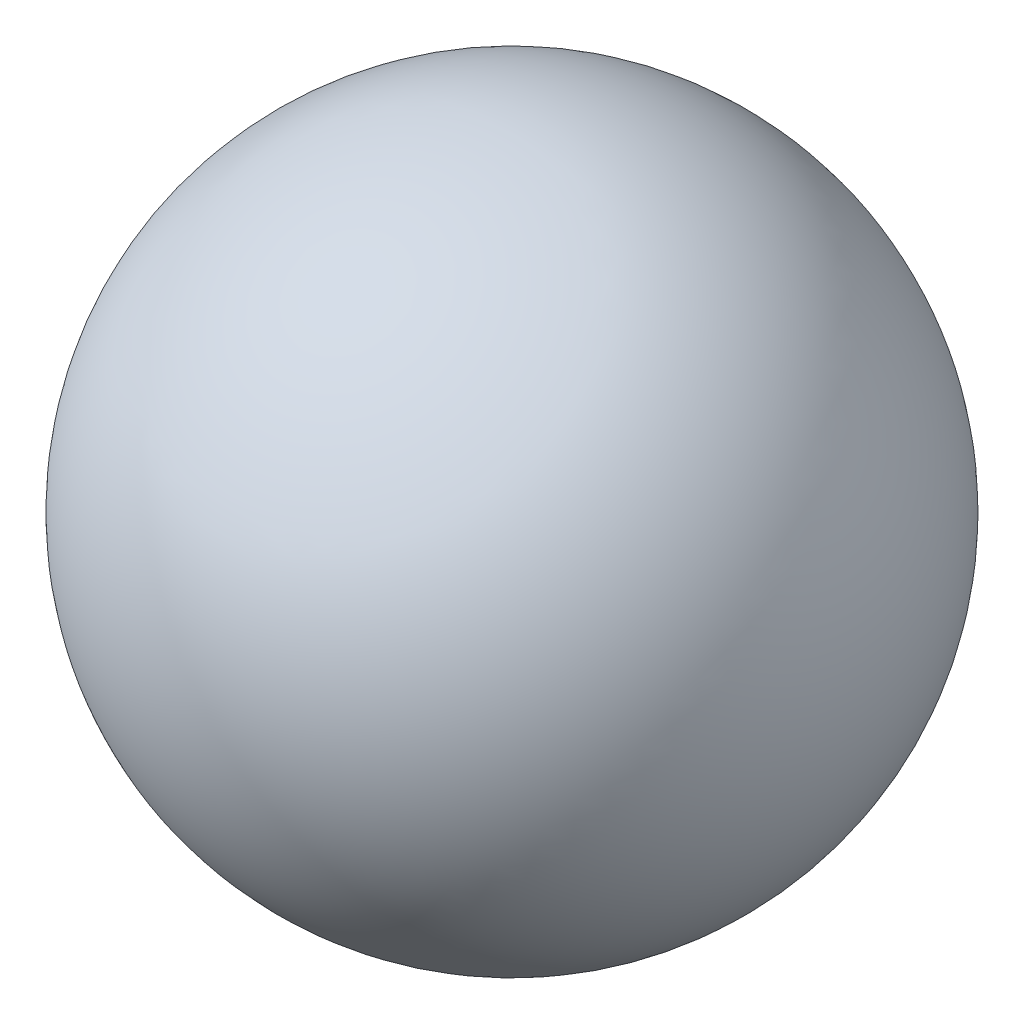
ISO-10303-21;
HEADER;
FILE_DESCRIPTION(('STEP AP214'),'2;1');
FILE_NAME('part.step','',(''),(''),'','','');
FILE_SCHEMA(('AUTOMOTIVE_DESIGN { 1 0 10303 214 1 1 1 1 }'));
ENDSEC;
DATA;
#1=APPLICATION_CONTEXT('core data for automotive mechanical design processes');
#2=APPLICATION_PROTOCOL_DEFINITION('international standard','automotive_design',2000,#1);
#3=PRODUCT_CONTEXT('',#1,'mechanical');
#4=PRODUCT('Part','Part','',(#3));
#5=PRODUCT_RELATED_PRODUCT_CATEGORY('part','',(#4));
#6=PRODUCT_DEFINITION_FORMATION('','',#4);
#7=PRODUCT_DEFINITION_CONTEXT('part definition',#1,'design');
#8=PRODUCT_DEFINITION('design','',#6,#7);
#9=PRODUCT_DEFINITION_SHAPE('','',#8);
#10=(LENGTH_UNIT() NAMED_UNIT(*) SI_UNIT(.MILLI.,.METRE.));
#11=(NAMED_UNIT(*) PLANE_ANGLE_UNIT() SI_UNIT($,.RADIAN.));
#12=(NAMED_UNIT(*) SI_UNIT($,.STERADIAN.) SOLID_ANGLE_UNIT());
#13=UNCERTAINTY_MEASURE_WITH_UNIT(LENGTH_MEASURE(1.E-05),#10,'distance_accuracy_value','');
#14=(GEOMETRIC_REPRESENTATION_CONTEXT(3) GLOBAL_UNCERTAINTY_ASSIGNED_CONTEXT((#13)) GLOBAL_UNIT_ASSIGNED_CONTEXT((#10,
#11,#12)) REPRESENTATION_CONTEXT('',''));
#15=CARTESIAN_POINT('',(0.,0.,0.));
#16=DIRECTION('',(0.,0.,1.));
#17=DIRECTION('',(1.,0.,0.));
#18=AXIS2_PLACEMENT_3D('',#15,#16,#17);
#19=CARTESIAN_POINT('',(0.,0.,-4.));
#20=DIRECTION('',(0.,0.,-1.));
#21=DIRECTION('',(-1.,0.,0.));
#22=AXIS2_PLACEMENT_3D('',#19,#20,#21);
#23=SPHERICAL_SURFACE('',#22,4.);
#24=CARTESIAN_POINT('',(0.,0.,-7.49999999999999));
#25=DIRECTION('',(0.,0.,-1.));
#26=DIRECTION('',(-1.,0.,0.));
#27=AXIS2_PLACEMENT_3D('',#24,#25,#26);
#28=CIRCLE('',#27,1.93649167310371);
#29=CARTESIAN_POINT('',(-1.93649167310371,0.,-7.49999999999999));
#30=VERTEX_POINT('',#29);
#31=EDGE_CURVE('E11',#30,#30,#28,.T.);
#32=ORIENTED_EDGE('',*,*,#31,.F.);
#33=EDGE_LOOP('',(#32));
#34=FACE_BOUND('',#33,.T.);
#35=ADVANCED_FACE('F38',(#34),#23,.T.);
#36=CARTESIAN_POINT('',(1.9364916731037,0.,-7.49999999999999));
#37=DIRECTION('',(0.,0.,1.));
#38=DIRECTION('',(1.,0.,0.));
#39=AXIS2_PLACEMENT_3D('',#36,#37,#38);
#40=PLANE('',#39);
#41=CARTESIAN_POINT('',(0.,0.,-7.50000000000001));
#42=DIRECTION('',(0.,0.,-1.));
#43=DIRECTION('',(-1.,0.,0.));
#44=AXIS2_PLACEMENT_3D('',#41,#42,#43);
#45=CIRCLE('',#44,1.24999999999999);
#46=CARTESIAN_POINT('',(-1.24999999999999,0.,-7.50000000000001));
#47=VERTEX_POINT('',#46);
#48=EDGE_CURVE('E56',#47,#47,#45,.T.);
#49=ORIENTED_EDGE('',*,*,#48,.F.);
#50=EDGE_LOOP('',(#49));
#51=FACE_BOUND('',#50,.T.);
#52=ORIENTED_EDGE('',*,*,#31,.T.);
#53=EDGE_LOOP('',(#52));
#54=FACE_BOUND('',#53,.T.);
#55=ADVANCED_FACE('F51',(#51,#54),#40,.F.);
#56=CARTESIAN_POINT('',(0.,0.,-1.5));
#57=DIRECTION('',(0.,0.,-1.));
#58=DIRECTION('',(-1.,0.,0.));
#59=AXIS2_PLACEMENT_3D('',#56,#57,#58);
#60=CONICAL_SURFACE('',#59,1.25,1.02974425867665);
#61=CARTESIAN_POINT('',(0.,0.,-0.748924226215544));
#62=VERTEX_POINT('',#61);
#63=VERTEX_LOOP('',#62);
#64=FACE_BOUND('',#63,.T.);
#65=CARTESIAN_POINT('',(0.,0.,-1.5));
#66=DIRECTION('',(0.,0.,-1.));
#67=DIRECTION('',(-1.,0.,0.));
#68=AXIS2_PLACEMENT_3D('',#65,#66,#67);
#69=CIRCLE('',#68,1.25);
#70=CARTESIAN_POINT('',(-1.25,0.,-1.5));
#71=VERTEX_POINT('',#70);
#72=EDGE_CURVE('E44',#71,#71,#69,.T.);
#73=ORIENTED_EDGE('',*,*,#72,.T.);
#74=EDGE_LOOP('',(#73));
#75=FACE_BOUND('',#74,.T.);
#76=ADVANCED_FACE('F47',(#64,#75),#60,.F.);
#77=CARTESIAN_POINT('',(0.,0.,-7.49999999999999));
#78=DIRECTION('',(0.,0.,-1.));
#79=DIRECTION('',(-1.,0.,0.));
#80=AXIS2_PLACEMENT_3D('',#77,#78,#79);
#81=CYLINDRICAL_SURFACE('',#80,1.24999999999999);
#82=ORIENTED_EDGE('',*,*,#72,.F.);
#83=EDGE_LOOP('',(#82));
#84=FACE_BOUND('',#83,.T.);
#85=ORIENTED_EDGE('',*,*,#48,.T.);
#86=EDGE_LOOP('',(#85));
#87=FACE_BOUND('',#86,.T.);
#88=ADVANCED_FACE('F50',(#84,#87),#81,.F.);
#89=CLOSED_SHELL('',(#35,#55,#76,#88));
#90=MANIFOLD_SOLID_BREP('B2',#89);
#91=ADVANCED_BREP_SHAPE_REPRESENTATION('',(#18,#90),#14);
#92=SHAPE_DEFINITION_REPRESENTATION(#9,#91);
ENDSEC;
END-ISO-10303-21;
